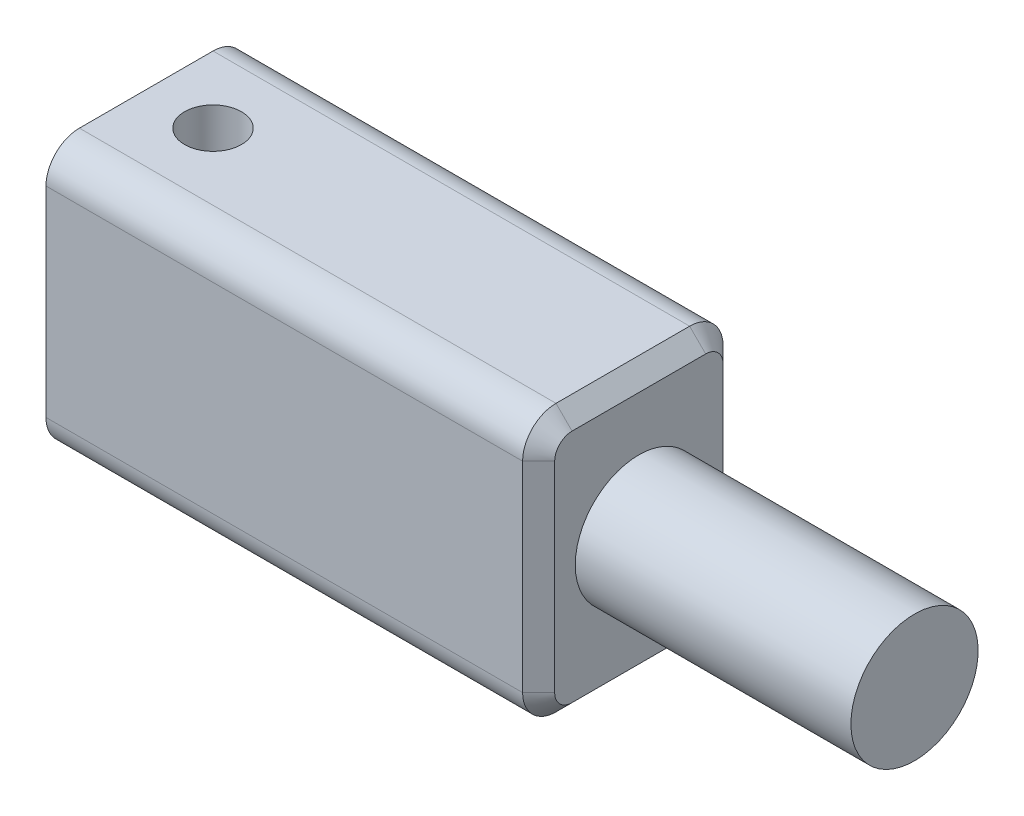
ISO-10303-21;
HEADER;
FILE_DESCRIPTION(('STEP AP214'),'2;1');
FILE_NAME('part.step','',(''),(''),'','','');
FILE_SCHEMA(('AUTOMOTIVE_DESIGN { 1 0 10303 214 1 1 1 1 }'));
ENDSEC;
DATA;
#1=APPLICATION_CONTEXT('core data for automotive mechanical design processes');
#2=APPLICATION_PROTOCOL_DEFINITION('international standard','automotive_design',2000,#1);
#3=PRODUCT_CONTEXT('',#1,'mechanical');
#4=PRODUCT('Part','Part','',(#3));
#5=PRODUCT_RELATED_PRODUCT_CATEGORY('part','',(#4));
#6=PRODUCT_DEFINITION_FORMATION('','',#4);
#7=PRODUCT_DEFINITION_CONTEXT('part definition',#1,'design');
#8=PRODUCT_DEFINITION('design','',#6,#7);
#9=PRODUCT_DEFINITION_SHAPE('','',#8);
#10=(LENGTH_UNIT() NAMED_UNIT(*) SI_UNIT(.MILLI.,.METRE.));
#11=(NAMED_UNIT(*) PLANE_ANGLE_UNIT() SI_UNIT($,.RADIAN.));
#12=(NAMED_UNIT(*) SI_UNIT($,.STERADIAN.) SOLID_ANGLE_UNIT());
#13=UNCERTAINTY_MEASURE_WITH_UNIT(LENGTH_MEASURE(1.E-05),#10,'distance_accuracy_value','');
#14=(GEOMETRIC_REPRESENTATION_CONTEXT(3) GLOBAL_UNCERTAINTY_ASSIGNED_CONTEXT((#13)) GLOBAL_UNIT_ASSIGNED_CONTEXT((#10,
#11,#12)) REPRESENTATION_CONTEXT('',''));
#15=CARTESIAN_POINT('',(0.,0.,0.));
#16=DIRECTION('',(0.,0.,1.));
#17=DIRECTION('',(1.,0.,0.));
#18=AXIS2_PLACEMENT_3D('',#15,#16,#17);
#19=CARTESIAN_POINT('',(39.28745,6.35,-4.7625));
#20=DIRECTION('',(0.,1.,0.));
#21=DIRECTION('',(0.,0.,1.));
#22=AXIS2_PLACEMENT_3D('',#19,#20,#21);
#23=PLANE('',#22);
#24=DIRECTION('',(-1.,0.,0.));
#25=VECTOR('',#24,1.);
#26=CARTESIAN_POINT('',(39.28745,6.35,3.175));
#27=LINE('',#26,#25);
#28=CARTESIAN_POINT('',(0.,6.35,3.175));
#29=VERTEX_POINT('',#28);
#30=CARTESIAN_POINT('',(22.65045,6.35,3.175));
#31=VERTEX_POINT('',#30);
#32=EDGE_CURVE('E491',#29,#31,#27,.F.);
#33=ORIENTED_EDGE('',*,*,#32,.T.);
#34=DIRECTION('',(0.,0.,-1.));
#35=VECTOR('',#34,1.);
#36=CARTESIAN_POINT('',(22.65045,6.35,-3.175));
#37=LINE('',#36,#35);
#38=CARTESIAN_POINT('',(22.65045,6.35,-3.175));
#39=VERTEX_POINT('',#38);
#40=EDGE_CURVE('E12',#31,#39,#37,.T.);
#41=ORIENTED_EDGE('',*,*,#40,.T.);
#42=DIRECTION('',(-1.,0.,0.));
#43=VECTOR('',#42,1.);
#44=CARTESIAN_POINT('',(39.28745,6.35,-3.175));
#45=LINE('',#44,#43);
#46=CARTESIAN_POINT('',(0.,6.35,-3.175));
#47=VERTEX_POINT('',#46);
#48=EDGE_CURVE('E493',#39,#47,#45,.T.);
#49=ORIENTED_EDGE('',*,*,#48,.T.);
#50=DIRECTION('',(0.,0.,-1.));
#51=VECTOR('',#50,1.);
#52=CARTESIAN_POINT('',(0.,6.35,-4.7625));
#53=LINE('',#52,#51);
#54=EDGE_CURVE('E454',#29,#47,#53,.T.);
#55=ORIENTED_EDGE('',*,*,#54,.F.);
#56=EDGE_LOOP('',(#33,#41,#49,#55));
#57=FACE_BOUND('',#56,.T.);
#58=CARTESIAN_POINT('',(3.175,6.35,0.));
#59=DIRECTION('',(0.,1.,0.));
#60=DIRECTION('',(0.,0.,1.));
#61=AXIS2_PLACEMENT_3D('',#58,#59,#60);
#62=CIRCLE('',#61,1.35255);
#63=CARTESIAN_POINT('',(3.175,6.35,1.35255));
#64=VERTEX_POINT('',#63);
#65=EDGE_CURVE('E568',#64,#64,#62,.T.);
#66=ORIENTED_EDGE('',*,*,#65,.F.);
#67=EDGE_LOOP('',(#66));
#68=FACE_BOUND('',#67,.T.);
#69=ADVANCED_FACE('F361',(#57,#68),#23,.T.);
#70=CARTESIAN_POINT('',(9.525,0.,0.));
#71=DIRECTION('',(-1.,0.,0.));
#72=DIRECTION('',(0.,0.,1.));
#73=AXIS2_PLACEMENT_3D('',#70,#71,#72);
#74=CYLINDRICAL_SURFACE('',#73,1.524);
#75=CARTESIAN_POINT('',(0.,0.,0.));
#76=DIRECTION('',(-1.,0.,0.));
#77=DIRECTION('',(0.,0.,1.));
#78=AXIS2_PLACEMENT_3D('',#75,#76,#77);
#79=CIRCLE('',#78,1.524);
#80=CARTESIAN_POINT('',(0.,0.,1.524));
#81=VERTEX_POINT('',#80);
#82=EDGE_CURVE('E663',#81,#81,#79,.T.);
#83=ORIENTED_EDGE('',*,*,#82,.T.);
#84=EDGE_LOOP('',(#83));
#85=FACE_BOUND('',#84,.T.);
#86=CARTESIAN_POINT('',(9.525,0.,0.));
#87=DIRECTION('',(-1.,0.,0.));
#88=DIRECTION('',(0.,0.,1.));
#89=AXIS2_PLACEMENT_3D('',#86,#87,#88);
#90=CIRCLE('',#89,1.524);
#91=CARTESIAN_POINT('',(9.525,0.,1.524));
#92=VERTEX_POINT('',#91);
#93=EDGE_CURVE('E469',#92,#92,#90,.T.);
#94=ORIENTED_EDGE('',*,*,#93,.F.);
#95=EDGE_LOOP('',(#94));
#96=FACE_BOUND('',#95,.T.);
#97=CARTESIAN_POINT('',(3.175,-0.702270957323452,1.35255));
#98=CARTESIAN_POINT('',(3.21707217968336,-0.702279979262497,1.35254717818324));
#99=CARTESIAN_POINT('',(3.2591643143721,-0.706141236265535,1.35056087661199));
#100=CARTESIAN_POINT('',(3.34184693441425,-0.720653947836462,1.3428680638871));
#101=CARTESIAN_POINT('',(3.38243196712902,-0.731327915477317,1.3371492168582));
#102=CARTESIAN_POINT('',(3.47957631490848,-0.763523860000407,1.31911937089296));
#103=CARTESIAN_POINT('',(3.53485012558653,-0.787779459464968,1.30498326977875));
#104=CARTESIAN_POINT('',(3.64094442790641,-0.841537752527547,1.27098829114154));
#105=CARTESIAN_POINT('',(3.69174649367795,-0.871060765628537,1.25110706036587));
#106=CARTESIAN_POINT('',(3.78085338917612,-0.926970786373431,1.21007746320126));
#107=CARTESIAN_POINT('',(3.81978213869841,-0.952992605080561,1.18977093749453));
#108=CARTESIAN_POINT('',(3.89523306169008,-1.00557944964072,1.14567324245321));
#109=CARTESIAN_POINT('',(3.93175381464058,-1.03214478422859,1.12188004246961));
#110=CARTESIAN_POINT('',(4.03772218242477,-1.11141960629747,1.04532115075714));
#111=CARTESIAN_POINT('',(4.10375714327414,-1.16382979548051,0.987292210958925));
#112=CARTESIAN_POINT('',(4.21080906979762,-1.2511587498098,0.872411103540684));
#113=CARTESIAN_POINT('',(4.25404882712305,-1.28728225322205,0.818528346752338));
#114=CARTESIAN_POINT('',(4.33294448831643,-1.35409562655333,0.702467042033983));
#115=CARTESIAN_POINT('',(4.36861337122796,-1.38479478025334,0.640302993841241));
#116=CARTESIAN_POINT('',(4.42456600797019,-1.43333461068743,0.521004660290256));
#117=CARTESIAN_POINT('',(4.44648803820053,-1.45251193129574,0.465187769180202));
#118=CARTESIAN_POINT('',(4.48302451531313,-1.48459940546605,0.349478423927672));
#119=CARTESIAN_POINT('',(4.4976433200318,-1.49751329628366,0.289588424509329));
#120=CARTESIAN_POINT('',(4.51866145662187,-1.5161089677639,0.166903556635082));
#121=CARTESIAN_POINT('',(4.52501436302095,-1.52174989820533,0.104094315594963));
#122=CARTESIAN_POINT('',(4.52883977769142,-1.52514445578943,-0.0220041355046523));
#123=CARTESIAN_POINT('',(4.52631460610187,-1.52290014361013,-0.0852932158525667));
#124=CARTESIAN_POINT('',(4.51323018247251,-1.51130303702087,-0.204441240571813));
#125=CARTESIAN_POINT('',(4.5034229544322,-1.50261571002647,-0.260452224794975));
#126=CARTESIAN_POINT('',(4.47726068872912,-1.47953693873412,-0.369682348683285));
#127=CARTESIAN_POINT('',(4.46090401488295,-1.46514406908574,-0.422900786953862));
#128=CARTESIAN_POINT('',(4.4212725144013,-1.43048290746596,-0.528760852731155));
#129=CARTESIAN_POINT('',(4.39763164437999,-1.40990567138485,-0.581162156614216));
#130=CARTESIAN_POINT('',(4.34491879370703,-1.36444751224133,-0.681085210018799));
#131=CARTESIAN_POINT('',(4.31584569876128,-1.33956570627468,-0.728605955302902));
#132=CARTESIAN_POINT('',(4.23676721794219,-1.27274377861347,-0.842025451480227));
#133=CARTESIAN_POINT('',(4.18375404315887,-1.22867618797298,-0.904579116775021));
#134=CARTESIAN_POINT('',(4.06909452295249,-1.13639682691843,-1.0181100655927));
#135=CARTESIAN_POINT('',(4.00740910463329,-1.0881667045469,-1.06903205444617));
#136=CARTESIAN_POINT('',(3.90832153448637,-1.01510729575818,-1.13722597152992));
#137=CARTESIAN_POINT('',(3.87375220166363,-0.990339529947954,-1.15879547172421));
#138=CARTESIAN_POINT('',(3.80244417231138,-0.941378567028568,-1.19890874898346));
#139=CARTESIAN_POINT('',(3.76570380499716,-0.917185833068511,-1.21745015327655));
#140=CARTESIAN_POINT('',(3.69008436595362,-0.870411845890656,-1.25131443016785));
#141=CARTESIAN_POINT('',(3.65121752518315,-0.847822804532961,-1.26665367715588));
#142=CARTESIAN_POINT('',(3.57090820653243,-0.805459169212386,-1.2940030210235));
#143=CARTESIAN_POINT('',(3.52947082334065,-0.785679248590163,-1.30601946074904));
#144=CARTESIAN_POINT('',(3.45022121831267,-0.75354551810751,-1.32477883385933));
#145=CARTESIAN_POINT('',(3.41281487347676,-0.740520008441139,-1.33204562784078));
#146=CARTESIAN_POINT('',(3.33619456686584,-0.719598636268923,-1.34346507565195));
#147=CARTESIAN_POINT('',(3.2969870537631,-0.711685800898481,-1.34762804061677));
#148=CARTESIAN_POINT('',(3.21710797519513,-0.702409401308774,-1.35249026637018));
#149=CARTESIAN_POINT('',(3.17642523200408,-0.701116833495169,-1.35315198189233));
#150=CARTESIAN_POINT('',(3.09553088696961,-0.705591670023033,-1.35082197843788));
#151=CARTESIAN_POINT('',(3.0553200575734,-0.71136935906665,-1.34782493729041));
#152=CARTESIAN_POINT('',(2.96792599485148,-0.730653206610229,-1.33748273346956));
#153=CARTESIAN_POINT('',(2.92117236186777,-0.745588304634533,-1.32932118208931));
#154=CARTESIAN_POINT('',(2.83073217898877,-0.780994820452487,-1.30883118995821));
#155=CARTESIAN_POINT('',(2.78705800023929,-0.801487125720679,-1.29648698358507));
#156=CARTESIAN_POINT('',(2.70657947746851,-0.843530277280837,-1.26948792522576));
#157=CARTESIAN_POINT('',(2.66951485821868,-0.864802087293333,-1.25515789758804));
#158=CARTESIAN_POINT('',(2.59748189898453,-0.908791447443696,-1.22368658903565));
#159=CARTESIAN_POINT('',(2.56251517718985,-0.931510086426917,-1.20654317516912));
#160=CARTESIAN_POINT('',(2.46039851996664,-1.00064820268408,-1.15098258898917));
#161=CARTESIAN_POINT('',(2.39608199798879,-1.04802113948181,-1.1084522840693));
#162=CARTESIAN_POINT('',(2.27070372804145,-1.14422575019542,-1.0091837203809));
#163=CARTESIAN_POINT('',(2.21015767539551,-1.19293882226644,-0.951678112407259));
#164=CARTESIAN_POINT('',(2.09902154373213,-1.28449682649553,-0.823882868449129));
#165=CARTESIAN_POINT('',(2.04840177038203,-1.32735914047292,-0.753632610525875));
#166=CARTESIAN_POINT('',(1.97407854020015,-1.39110139465381,-0.625138330755869));
#167=CARTESIAN_POINT('',(1.94693733014504,-1.41463456160875,-0.570197342077547));
#168=CARTESIAN_POINT('',(1.89983630684233,-1.45571040309329,-0.455192241264111));
#169=CARTESIAN_POINT('',(1.87987167295367,-1.47325709844374,-0.395131601769294));
#170=CARTESIAN_POINT('',(1.84825012351509,-1.50113078852859,-0.270691843317126));
#171=CARTESIAN_POINT('',(1.83665787260538,-1.51140157591453,-0.206283225701143));
#172=CARTESIAN_POINT('',(1.82297811137812,-1.52352783509803,-0.0756874888437563));
#173=CARTESIAN_POINT('',(1.82088452196937,-1.52538868920375,-0.00950153438310301));
#174=CARTESIAN_POINT('',(1.8260402528428,-1.52081442502809,0.114416735355444));
#175=CARTESIAN_POINT('',(1.83222731326676,-1.51532250764779,0.172233851767758));
#176=CARTESIAN_POINT('',(1.85171165075638,-1.4980841090639,0.285679418145234));
#177=CARTESIAN_POINT('',(1.86500979574868,-1.48633686438186,0.341307600055206));
#178=CARTESIAN_POINT('',(1.89819349259866,-1.45717382833434,0.44992535727258));
#179=CARTESIAN_POINT('',(1.91817426416168,-1.43967616673655,0.502863253682306));
#180=CARTESIAN_POINT('',(1.96372547923972,-1.40008735638288,0.604406875098513));
#181=CARTESIAN_POINT('',(1.98929839165491,-1.37799417894228,0.653010673238715));
#182=CARTESIAN_POINT('',(2.05865277909166,-1.31869140295251,0.76784024535857));
#183=CARTESIAN_POINT('',(2.10526627176798,-1.27933163768512,0.831252992794772));
#184=CARTESIAN_POINT('',(2.20672301106169,-1.19578970513987,0.94753267865525));
#185=CARTESIAN_POINT('',(2.26158852232377,-1.15159458238565,1.00037015658202));
#186=CARTESIAN_POINT('',(2.3796383931867,-1.06033696777279,1.0966905635919));
#187=CARTESIAN_POINT('',(2.44297795272761,-1.01323298272958,1.139944603812));
#188=CARTESIAN_POINT('',(2.54349555096642,-0.944142696962623,1.19668945693576));
#189=CARTESIAN_POINT('',(2.57790705707033,-0.921380886359577,1.21424387045927));
#190=CARTESIAN_POINT('',(2.64876636319789,-0.87711865651036,1.24659001415373));
#191=CARTESIAN_POINT('',(2.68521266158619,-0.855617330460224,1.26138374753475));
#192=CARTESIAN_POINT('',(2.76272124728248,-0.813651054483193,1.28888076750124));
#193=CARTESIAN_POINT('',(2.80392956253207,-0.793330991337368,1.30139972257987));
#194=CARTESIAN_POINT('',(2.88917980052923,-0.757231243757115,1.32273075371325));
#195=CARTESIAN_POINT('',(2.93321346873306,-0.741439009371421,1.33155310775882));
#196=CARTESIAN_POINT('',(3.01037129337357,-0.720661433028069,1.34287789414377));
#197=CARTESIAN_POINT('',(3.04283129557991,-0.713857614010815,1.34648053559675));
#198=CARTESIAN_POINT('',(3.10852414729912,-0.704661911686318,1.35131603825143));
#199=CARTESIAN_POINT('',(3.14175584401672,-0.702263828461787,1.35255222971372));
#200=CARTESIAN_POINT('',(3.175,-0.702270957323452,1.35255));
#201=B_SPLINE_CURVE_WITH_KNOTS('',3,(#97,#98,#99,#100,#101,#102,#103,#104,#105,#106,#107,#108,
#109,#110,#111,#112,#113,#114,#115,#116,#117,#118,#119,#120,#121,#122,#123,#124,#125,#126,#127,
#128,#129,#130,#131,#132,#133,#134,#135,#136,#137,#138,#139,#140,#141,#142,#143,#144,#145,#146,
#147,#148,#149,#150,#151,#152,#153,#154,#155,#156,#157,#158,#159,#160,#161,#162,#163,#164,#165,
#166,#167,#168,#169,#170,#171,#172,#173,#174,#175,#176,#177,#178,#179,#180,#181,#182,#183,#184,
#185,#186,#187,#188,#189,#190,#191,#192,#193,#194,#195,#196,#197,#198,#199,#200),.UNSPECIFIED.,
.T.,.F.,(4,2,2,2,2,2,2,2,2,2,2,2,2,2,2,2,2,2,2,2,2,2,2,2,2,2,2,2,2,2,2,2,2,2,2,2,2,2,2,2,2,2,2,
2,2,2,2,2,2,2,2,4),(0.,0.126063369193998,0.252545495709718,0.437479934952307,0.623143838396348,
0.776063927680587,0.929073434650462,1.23439828791887,1.46749024436466,1.70017931576062,
1.88829730084201,2.07630290140219,2.26535994238806,2.45436758011159,2.62617526171937,
2.79802589114982,2.98053101244574,3.16307361158685,3.44084358107695,3.71990773794989,
3.86284266811253,4.00588906812932,4.14818503530543,4.29020747117032,4.41064990338174,
4.53069041254542,4.65201559213964,4.77351746658282,4.92194493525667,5.07093821082692,
5.20597279661751,5.34111023507301,5.61156354361266,5.90033933011229,6.18823760822231,
6.38443434883885,6.58049905305646,6.77806233685239,6.97549916337932,7.14988497386687,
7.32429207346217,7.50129839279643,7.67838301781703,7.94091316310625,8.20416478347162,
8.47315188413674,8.60755574743725,8.74186170186414,8.88442113164787,9.02658151740235,
9.12633343769168,9.22594487548273),.UNSPECIFIED.);
#202=CARTESIAN_POINT('',(3.175,-0.702270957323452,1.35255));
#203=VERTEX_POINT('',#202);
#204=EDGE_CURVE('E666',#203,#203,#201,.T.);
#205=ORIENTED_EDGE('',*,*,#204,.F.);
#206=EDGE_LOOP('',(#205));
#207=FACE_BOUND('',#206,.T.);
#208=CARTESIAN_POINT('',(3.175,0.702270957323452,-1.35255));
#209=CARTESIAN_POINT('',(3.13292782031664,0.702279979262497,-1.35254717818324));
#210=CARTESIAN_POINT('',(3.09083568562791,0.706141236265535,-1.35056087661199));
#211=CARTESIAN_POINT('',(3.00815306558575,0.720653947836462,-1.3428680638871));
#212=CARTESIAN_POINT('',(2.96756803287098,0.731327915477317,-1.3371492168582));
#213=CARTESIAN_POINT('',(2.87042368509153,0.763523860000406,-1.31911937089296));
#214=CARTESIAN_POINT('',(2.81514987441348,0.787779459464967,-1.30498326977875));
#215=CARTESIAN_POINT('',(2.70905557209359,0.841537752527545,-1.27098829114155));
#216=CARTESIAN_POINT('',(2.65825350632205,0.871060765628536,-1.25110706036587));
#217=CARTESIAN_POINT('',(2.56914661082389,0.926970786373429,-1.21007746320126));
#218=CARTESIAN_POINT('',(2.5302178613016,0.952992605080559,-1.18977093749453));
#219=CARTESIAN_POINT('',(2.45476693830992,1.00557944964072,-1.14567324245321));
#220=CARTESIAN_POINT('',(2.41824618535943,1.03214478422859,-1.12188004246961));
#221=CARTESIAN_POINT('',(2.31227781757523,1.11141960629746,-1.04532115075715));
#222=CARTESIAN_POINT('',(2.24624285672587,1.1638297954805,-0.987292210958928));
#223=CARTESIAN_POINT('',(2.13919093020239,1.25115874980979,-0.872411103540687));
#224=CARTESIAN_POINT('',(2.09595117287696,1.28728225322204,-0.818528346752341));
#225=CARTESIAN_POINT('',(2.01705551168357,1.35409562655333,-0.702467042033986));
#226=CARTESIAN_POINT('',(1.98138662877205,1.38479478025334,-0.640302993841243));
#227=CARTESIAN_POINT('',(1.92543399202981,1.43333461068743,-0.521004660290258));
#228=CARTESIAN_POINT('',(1.90351196179947,1.45251193129574,-0.465187769180204));
#229=CARTESIAN_POINT('',(1.86697548468687,1.48459940546604,-0.349478423927675));
#230=CARTESIAN_POINT('',(1.8523566799682,1.49751329628366,-0.289588424509331));
#231=CARTESIAN_POINT('',(1.83133854337813,1.5161089677639,-0.166903556635084));
#232=CARTESIAN_POINT('',(1.82498563697905,1.52174989820533,-0.104094315594965));
#233=CARTESIAN_POINT('',(1.82116022230858,1.52514445578943,0.0220041355046508));
#234=CARTESIAN_POINT('',(1.82368539389813,1.52290014361013,0.0852932158525652));
#235=CARTESIAN_POINT('',(1.83676981752749,1.51130303702087,0.204441240571811));
#236=CARTESIAN_POINT('',(1.8465770455678,1.50261571002648,0.260452224794973));
#237=CARTESIAN_POINT('',(1.87273931127088,1.47953693873412,0.369682348683283));
#238=CARTESIAN_POINT('',(1.88909598511706,1.46514406908574,0.422900786953861));
#239=CARTESIAN_POINT('',(1.9287274855987,1.43048290746596,0.528760852731154));
#240=CARTESIAN_POINT('',(1.95236835562001,1.40990567138485,0.581162156614215));
#241=CARTESIAN_POINT('',(2.00508120629297,1.36444751224134,0.681085210018798));
#242=CARTESIAN_POINT('',(2.03415430123872,1.33956570627468,0.728605955302901));
#243=CARTESIAN_POINT('',(2.11323278205781,1.27274377861347,0.842025451480226));
#244=CARTESIAN_POINT('',(2.16624595684113,1.22867618797298,0.90457911677502));
#245=CARTESIAN_POINT('',(2.28090547704751,1.13639682691844,1.0181100655927));
#246=CARTESIAN_POINT('',(2.34259089536671,1.0881667045469,1.06903205444617));
#247=CARTESIAN_POINT('',(2.44167846551363,1.01510729575818,1.13722597152992));
#248=CARTESIAN_POINT('',(2.47624779833637,0.990339529947954,1.15879547172421));
#249=CARTESIAN_POINT('',(2.54755582768862,0.941378567028568,1.19890874898346));
#250=CARTESIAN_POINT('',(2.58429619500284,0.917185833068512,1.21745015327655));
#251=CARTESIAN_POINT('',(2.65991563404638,0.870411845890657,1.25131443016785));
#252=CARTESIAN_POINT('',(2.69878247481685,0.847822804532962,1.26665367715588));
#253=CARTESIAN_POINT('',(2.77909179346757,0.805459169212386,1.29400302102349));
#254=CARTESIAN_POINT('',(2.82052917665935,0.785679248590163,1.30601946074904));
#255=CARTESIAN_POINT('',(2.89977878168733,0.75354551810751,1.32477883385933));
#256=CARTESIAN_POINT('',(2.93718512652324,0.74052000844114,1.33204562784078));
#257=CARTESIAN_POINT('',(3.01380543313416,0.719598636268924,1.34346507565195));
#258=CARTESIAN_POINT('',(3.0530129462369,0.711685800898481,1.34762804061677));
#259=CARTESIAN_POINT('',(3.13289202480486,0.702409401308774,1.35249026637018));
#260=CARTESIAN_POINT('',(3.17357476799592,0.701116833495169,1.35315198189233));
#261=CARTESIAN_POINT('',(3.25446911303039,0.705591670023033,1.35082197843788));
#262=CARTESIAN_POINT('',(3.2946799424266,0.711369359066649,1.34782493729041));
#263=CARTESIAN_POINT('',(3.38207400514852,0.730653206610228,1.33748273346957));
#264=CARTESIAN_POINT('',(3.42882763813223,0.745588304634532,1.32932118208931));
#265=CARTESIAN_POINT('',(3.51926782101123,0.780994820452486,1.30883118995821));
#266=CARTESIAN_POINT('',(3.56294199976071,0.801487125720678,1.29648698358507));
#267=CARTESIAN_POINT('',(3.64342052253149,0.843530277280835,1.26948792522577));
#268=CARTESIAN_POINT('',(3.68048514178132,0.864802087293331,1.25515789758804));
#269=CARTESIAN_POINT('',(3.75251810101547,0.908791447443695,1.22368658903565));
#270=CARTESIAN_POINT('',(3.78748482281015,0.931510086426917,1.20654317516912));
#271=CARTESIAN_POINT('',(3.88960148003336,1.00064820268408,1.15098258898917));
#272=CARTESIAN_POINT('',(3.95391800201121,1.04802113948181,1.1084522840693));
#273=CARTESIAN_POINT('',(4.07929627195855,1.14422575019542,1.0091837203809));
#274=CARTESIAN_POINT('',(4.13984232460449,1.19293882226644,0.951678112407258));
#275=CARTESIAN_POINT('',(4.25097845626788,1.28449682649553,0.823882868449127));
#276=CARTESIAN_POINT('',(4.30159822961797,1.32735914047292,0.753632610525872));
#277=CARTESIAN_POINT('',(4.37592145979985,1.39110139465382,0.625138330755867));
#278=CARTESIAN_POINT('',(4.40306266985496,1.41463456160875,0.570197342077545));
#279=CARTESIAN_POINT('',(4.45016369315767,1.4557104030933,0.455192241264108));
#280=CARTESIAN_POINT('',(4.47012832704634,1.47325709844374,0.395131601769292));
#281=CARTESIAN_POINT('',(4.50174987648491,1.50113078852859,0.270691843317123));
#282=CARTESIAN_POINT('',(4.51334212739462,1.51140157591453,0.206283225701141));
#283=CARTESIAN_POINT('',(4.52702188862188,1.52352783509803,0.0756874888437545));
#284=CARTESIAN_POINT('',(4.52911547803063,1.52538868920375,0.00950153438310112));
#285=CARTESIAN_POINT('',(4.5239597471572,1.52081442502809,-0.114416735355446));
#286=CARTESIAN_POINT('',(4.51777268673324,1.51532250764779,-0.17223385176776));
#287=CARTESIAN_POINT('',(4.49828834924362,1.4980841090639,-0.285679418145236));
#288=CARTESIAN_POINT('',(4.48499020425132,1.48633686438186,-0.341307600055208));
#289=CARTESIAN_POINT('',(4.45180650740135,1.45717382833434,-0.449925357272581));
#290=CARTESIAN_POINT('',(4.43182573583832,1.43967616673655,-0.502863253682307));
#291=CARTESIAN_POINT('',(4.38627452076028,1.40008735638288,-0.604406875098515));
#292=CARTESIAN_POINT('',(4.36070160834509,1.37799417894228,-0.653010673238716));
#293=CARTESIAN_POINT('',(4.29134722090834,1.31869140295251,-0.76784024535857));
#294=CARTESIAN_POINT('',(4.24473372823202,1.27933163768512,-0.831252992794773));
#295=CARTESIAN_POINT('',(4.14327698893831,1.19578970513987,-0.947532678655251));
#296=CARTESIAN_POINT('',(4.08841147767623,1.15159458238565,-1.00037015658202));
#297=CARTESIAN_POINT('',(3.9703616068133,1.06033696777279,-1.0966905635919));
#298=CARTESIAN_POINT('',(3.90702204727239,1.01323298272958,-1.139944603812));
#299=CARTESIAN_POINT('',(3.80650444903359,0.944142696962624,-1.19668945693576));
#300=CARTESIAN_POINT('',(3.77209294292968,0.921380886359578,-1.21424387045927));
#301=CARTESIAN_POINT('',(3.70123363680212,0.87711865651036,-1.24659001415372));
#302=CARTESIAN_POINT('',(3.66478733841381,0.855617330460224,-1.26138374753475));
#303=CARTESIAN_POINT('',(3.58727875271752,0.813651054483192,-1.28888076750124));
#304=CARTESIAN_POINT('',(3.54607043746793,0.793330991337368,-1.30139972257987));
#305=CARTESIAN_POINT('',(3.46082019947077,0.757231243757114,-1.32273075371325));
#306=CARTESIAN_POINT('',(3.41678653126694,0.741439009371421,-1.33155310775882));
#307=CARTESIAN_POINT('',(3.33962870662643,0.720661433028069,-1.34287789414377));
#308=CARTESIAN_POINT('',(3.30716870442009,0.713857614010815,-1.34648053559675));
#309=CARTESIAN_POINT('',(3.24147585270088,0.704661911686318,-1.35131603825143));
#310=CARTESIAN_POINT('',(3.20824415598328,0.702263828461787,-1.35255222971372));
#311=CARTESIAN_POINT('',(3.175,0.702270957323452,-1.35255));
#312=B_SPLINE_CURVE_WITH_KNOTS('',3,(#208,#209,#210,#211,#212,#213,#214,#215,#216,#217,#218,
#219,#220,#221,#222,#223,#224,#225,#226,#227,#228,#229,#230,#231,#232,#233,#234,#235,#236,#237,
#238,#239,#240,#241,#242,#243,#244,#245,#246,#247,#248,#249,#250,#251,#252,#253,#254,#255,#256,
#257,#258,#259,#260,#261,#262,#263,#264,#265,#266,#267,#268,#269,#270,#271,#272,#273,#274,#275,
#276,#277,#278,#279,#280,#281,#282,#283,#284,#285,#286,#287,#288,#289,#290,#291,#292,#293,#294,
#295,#296,#297,#298,#299,#300,#301,#302,#303,#304,#305,#306,#307,#308,#309,#310,#311),
.UNSPECIFIED.,.T.,.F.,(4,2,2,2,2,2,2,2,2,2,2,2,2,2,2,2,2,2,2,2,2,2,2,2,2,2,2,2,2,2,2,2,2,2,2,2,
2,2,2,2,2,2,2,2,2,2,2,2,2,2,2,4),(0.,0.126063369193998,0.252545495709717,0.437479934952305,
0.623143838396345,0.776063927680584,0.929073434650458,1.23439828791887,1.46749024436466,
1.70017931576062,1.88829730084201,2.07630290140219,2.26535994238806,2.45436758011159,
2.62617526171937,2.79802589114982,2.98053101244574,3.16307361158685,3.44084358107695,
3.71990773794989,3.86284266811252,4.00588906812931,4.14818503530542,4.29020747117032,
4.41064990338174,4.53069041254541,4.65201559213964,4.77351746658282,4.92194493525667,
5.07093821082692,5.20597279661751,5.34111023507301,5.61156354361265,5.90033933011229,
6.18823760822231,6.38443434883885,6.58049905305646,6.77806233685239,6.97549916337932,
7.14988497386687,7.32429207346217,7.50129839279643,7.67838301781703,7.94091316310625,
8.20416478347162,8.47315188413674,8.60755574743725,8.74186170186414,8.88442113164787,
9.02658151740235,9.12633343769168,9.22594487548273),.UNSPECIFIED.);
#313=CARTESIAN_POINT('',(3.175,0.702270957323452,-1.35255));
#314=VERTEX_POINT('',#313);
#315=EDGE_CURVE('E561',#314,#314,#312,.T.);
#316=ORIENTED_EDGE('',*,*,#315,.T.);
#317=EDGE_LOOP('',(#316));
#318=FACE_BOUND('',#317,.T.);
#319=ADVANCED_FACE('F617',(#85,#96,#207,#318),#74,.F.);
#320=CARTESIAN_POINT('',(23.41245,4.7625,0.));
#321=DIRECTION('',(-1.,0.,0.));
#322=DIRECTION('',(0.,0.,1.));
#323=AXIS2_PLACEMENT_3D('',#320,#321,#322);
#324=PLANE('',#323);
#325=CARTESIAN_POINT('',(23.41245,-4.7625,3.175));
#326=DIRECTION('',(-1.,0.,0.));
#327=DIRECTION('',(0.,0.,1.));
#328=AXIS2_PLACEMENT_3D('',#325,#326,#327);
#329=CIRCLE('',#328,0.825500000000002);
#330=CARTESIAN_POINT('',(23.41245,-4.7625,4.0005));
#331=VERTEX_POINT('',#330);
#332=CARTESIAN_POINT('',(23.41245,-5.588,3.175));
#333=VERTEX_POINT('',#332);
#334=EDGE_CURVE('E510',#331,#333,#329,.F.);
#335=ORIENTED_EDGE('',*,*,#334,.T.);
#336=DIRECTION('',(0.,0.,-1.));
#337=VECTOR('',#336,1.);
#338=CARTESIAN_POINT('',(23.41245,-5.588,-3.175));
#339=LINE('',#338,#337);
#340=CARTESIAN_POINT('',(23.41245,-5.588,-3.175));
#341=VERTEX_POINT('',#340);
#342=EDGE_CURVE('E514',#333,#341,#339,.T.);
#343=ORIENTED_EDGE('',*,*,#342,.T.);
#344=CARTESIAN_POINT('',(23.41245,-4.7625,-3.175));
#345=DIRECTION('',(-1.,0.,0.));
#346=DIRECTION('',(0.,0.,1.));
#347=AXIS2_PLACEMENT_3D('',#344,#345,#346);
#348=CIRCLE('',#347,0.825500000000001);
#349=CARTESIAN_POINT('',(23.41245,-4.7625,-4.0005));
#350=VERTEX_POINT('',#349);
#351=EDGE_CURVE('E512',#341,#350,#348,.F.);
#352=ORIENTED_EDGE('',*,*,#351,.T.);
#353=DIRECTION('',(0.,1.,0.));
#354=VECTOR('',#353,1.);
#355=CARTESIAN_POINT('',(23.41245,4.7625,-4.0005));
#356=LINE('',#355,#354);
#357=CARTESIAN_POINT('',(23.41245,4.7625,-4.0005));
#358=VERTEX_POINT('',#357);
#359=EDGE_CURVE('E508',#350,#358,#356,.T.);
#360=ORIENTED_EDGE('',*,*,#359,.T.);
#361=CARTESIAN_POINT('',(23.41245,4.7625,-3.175));
#362=DIRECTION('',(-1.,0.,0.));
#363=DIRECTION('',(0.,0.,1.));
#364=AXIS2_PLACEMENT_3D('',#361,#362,#363);
#365=CIRCLE('',#364,0.825500000000002);
#366=CARTESIAN_POINT('',(23.41245,5.588,-3.175));
#367=VERTEX_POINT('',#366);
#368=EDGE_CURVE('E504',#358,#367,#365,.F.);
#369=ORIENTED_EDGE('',*,*,#368,.T.);
#370=DIRECTION('',(0.,0.,1.));
#371=VECTOR('',#370,1.);
#372=CARTESIAN_POINT('',(23.41245,5.588,3.175));
#373=LINE('',#372,#371);
#374=CARTESIAN_POINT('',(23.41245,5.588,3.175));
#375=VERTEX_POINT('',#374);
#376=EDGE_CURVE('E500',#367,#375,#373,.T.);
#377=ORIENTED_EDGE('',*,*,#376,.T.);
#378=CARTESIAN_POINT('',(23.41245,4.7625,3.175));
#379=DIRECTION('',(-1.,0.,0.));
#380=DIRECTION('',(0.,0.,1.));
#381=AXIS2_PLACEMENT_3D('',#378,#379,#380);
#382=CIRCLE('',#381,0.825500000000001);
#383=CARTESIAN_POINT('',(23.41245,4.7625,4.0005));
#384=VERTEX_POINT('',#383);
#385=EDGE_CURVE('E502',#375,#384,#382,.F.);
#386=ORIENTED_EDGE('',*,*,#385,.T.);
#387=DIRECTION('',(0.,-1.,0.));
#388=VECTOR('',#387,1.);
#389=CARTESIAN_POINT('',(23.41245,-4.7625,4.0005));
#390=LINE('',#389,#388);
#391=EDGE_CURVE('E506',#384,#331,#390,.T.);
#392=ORIENTED_EDGE('',*,*,#391,.T.);
#393=EDGE_LOOP('',(#335,#343,#352,#360,#369,#377,#386,#392));
#394=FACE_BOUND('',#393,.T.);
#395=CARTESIAN_POINT('',(23.41245,0.,0.));
#396=DIRECTION('',(-1.,0.,0.));
#397=DIRECTION('',(0.,0.,1.));
#398=AXIS2_PLACEMENT_3D('',#395,#396,#397);
#399=CIRCLE('',#398,3.0226);
#400=CARTESIAN_POINT('',(23.41245,0.,3.0226));
#401=VERTEX_POINT('',#400);
#402=EDGE_CURVE('E474',#401,#401,#399,.T.);
#403=ORIENTED_EDGE('',*,*,#402,.T.);
#404=EDGE_LOOP('',(#403));
#405=FACE_BOUND('',#404,.T.);
#406=ADVANCED_FACE('F624',(#394,#405),#324,.F.);
#407=CARTESIAN_POINT('',(0.,0.,0.));
#408=DIRECTION('',(-1.,0.,0.));
#409=DIRECTION('',(0.,0.,1.));
#410=AXIS2_PLACEMENT_3D('',#407,#408,#409);
#411=CYLINDRICAL_SURFACE('',#410,3.0226);
#412=ORIENTED_EDGE('',*,*,#402,.F.);
#413=EDGE_LOOP('',(#412));
#414=FACE_BOUND('',#413,.T.);
#415=CARTESIAN_POINT('',(36.5125,0.,0.));
#416=DIRECTION('',(-1.,0.,0.));
#417=DIRECTION('',(0.,0.,1.));
#418=AXIS2_PLACEMENT_3D('',#415,#416,#417);
#419=CIRCLE('',#418,3.0226);
#420=CARTESIAN_POINT('',(36.5125,0.,3.0226));
#421=VERTEX_POINT('',#420);
#422=EDGE_CURVE('E479',#421,#421,#419,.T.);
#423=ORIENTED_EDGE('',*,*,#422,.T.);
#424=EDGE_LOOP('',(#423));
#425=FACE_BOUND('',#424,.T.);
#426=ADVANCED_FACE('F641',(#414,#425),#411,.T.);
#427=CARTESIAN_POINT('',(36.5125,3.0226,0.));
#428=DIRECTION('',(-1.,0.,0.));
#429=DIRECTION('',(0.,0.,1.));
#430=AXIS2_PLACEMENT_3D('',#427,#428,#429);
#431=PLANE('',#430);
#432=ORIENTED_EDGE('',*,*,#422,.F.);
#433=EDGE_LOOP('',(#432));
#434=FACE_BOUND('',#433,.T.);
#435=ADVANCED_FACE('F638',(#434),#431,.F.);
#436=CARTESIAN_POINT('',(39.28745,-6.35,-4.7625));
#437=DIRECTION('',(0.,0.,-1.));
#438=DIRECTION('',(-1.,0.,0.));
#439=AXIS2_PLACEMENT_3D('',#436,#437,#438);
#440=PLANE('',#439);
#441=DIRECTION('',(-1.,0.,0.));
#442=VECTOR('',#441,1.);
#443=CARTESIAN_POINT('',(39.28745,4.7625,-4.7625));
#444=LINE('',#443,#442);
#445=CARTESIAN_POINT('',(0.,4.7625,-4.7625));
#446=VERTEX_POINT('',#445);
#447=CARTESIAN_POINT('',(22.65045,4.7625,-4.7625));
#448=VERTEX_POINT('',#447);
#449=EDGE_CURVE('E463',#446,#448,#444,.F.);
#450=ORIENTED_EDGE('',*,*,#449,.T.);
#451=DIRECTION('',(0.,-1.,0.));
#452=VECTOR('',#451,1.);
#453=CARTESIAN_POINT('',(22.65045,-4.7625,-4.7625));
#454=LINE('',#453,#452);
#455=CARTESIAN_POINT('',(22.65045,-4.7625,-4.7625));
#456=VERTEX_POINT('',#455);
#457=EDGE_CURVE('E524',#448,#456,#454,.T.);
#458=ORIENTED_EDGE('',*,*,#457,.T.);
#459=DIRECTION('',(-1.,0.,0.));
#460=VECTOR('',#459,1.);
#461=CARTESIAN_POINT('',(39.28745,-4.7625,-4.7625));
#462=LINE('',#461,#460);
#463=CARTESIAN_POINT('',(0.,-4.7625,-4.7625));
#464=VERTEX_POINT('',#463);
#465=EDGE_CURVE('E466',#456,#464,#462,.T.);
#466=ORIENTED_EDGE('',*,*,#465,.T.);
#467=DIRECTION('',(0.,-1.,0.));
#468=VECTOR('',#467,1.);
#469=CARTESIAN_POINT('',(0.,-6.35,-4.7625));
#470=LINE('',#469,#468);
#471=EDGE_CURVE('E452',#446,#464,#470,.T.);
#472=ORIENTED_EDGE('',*,*,#471,.F.);
#473=EDGE_LOOP('',(#450,#458,#466,#472));
#474=FACE_BOUND('',#473,.T.);
#475=ADVANCED_FACE('F462',(#474),#440,.T.);
#476=CARTESIAN_POINT('',(39.28745,-6.35,4.7625));
#477=DIRECTION('',(0.,0.,1.));
#478=DIRECTION('',(1.,0.,0.));
#479=AXIS2_PLACEMENT_3D('',#476,#477,#478);
#480=PLANE('',#479);
#481=DIRECTION('',(-1.,0.,0.));
#482=VECTOR('',#481,1.);
#483=CARTESIAN_POINT('',(39.28745,-4.7625,4.7625));
#484=LINE('',#483,#482);
#485=CARTESIAN_POINT('',(0.,-4.7625,4.7625));
#486=VERTEX_POINT('',#485);
#487=CARTESIAN_POINT('',(22.65045,-4.7625,4.7625));
#488=VERTEX_POINT('',#487);
#489=EDGE_CURVE('E495',#486,#488,#484,.F.);
#490=ORIENTED_EDGE('',*,*,#489,.T.);
#491=DIRECTION('',(0.,1.,0.));
#492=VECTOR('',#491,1.);
#493=CARTESIAN_POINT('',(22.65045,4.7625,4.7625));
#494=LINE('',#493,#492);
#495=CARTESIAN_POINT('',(22.65045,4.7625,4.7625));
#496=VERTEX_POINT('',#495);
#497=EDGE_CURVE('E526',#488,#496,#494,.T.);
#498=ORIENTED_EDGE('',*,*,#497,.T.);
#499=DIRECTION('',(-1.,0.,0.));
#500=VECTOR('',#499,1.);
#501=CARTESIAN_POINT('',(39.28745,4.7625,4.7625));
#502=LINE('',#501,#500);
#503=CARTESIAN_POINT('',(0.,4.7625,4.7625));
#504=VERTEX_POINT('',#503);
#505=EDGE_CURVE('E498',#496,#504,#502,.T.);
#506=ORIENTED_EDGE('',*,*,#505,.T.);
#507=DIRECTION('',(0.,1.,0.));
#508=VECTOR('',#507,1.);
#509=CARTESIAN_POINT('',(0.,-6.35,4.7625));
#510=LINE('',#509,#508);
#511=EDGE_CURVE('E655',#486,#504,#510,.T.);
#512=ORIENTED_EDGE('',*,*,#511,.F.);
#513=EDGE_LOOP('',(#490,#498,#506,#512));
#514=FACE_BOUND('',#513,.T.);
#515=ADVANCED_FACE('F530',(#514),#480,.T.);
#516=CARTESIAN_POINT('',(39.28745,-6.35,-4.7625));
#517=DIRECTION('',(0.,-1.,0.));
#518=DIRECTION('',(0.,0.,-1.));
#519=AXIS2_PLACEMENT_3D('',#516,#517,#518);
#520=PLANE('',#519);
#521=CARTESIAN_POINT('',(3.175,-6.35,0.));
#522=DIRECTION('',(0.,-1.,0.));
#523=DIRECTION('',(0.,0.,-1.));
#524=AXIS2_PLACEMENT_3D('',#521,#522,#523);
#525=CIRCLE('',#524,1.35255);
#526=CARTESIAN_POINT('',(3.175,-6.35,-1.35255));
#527=VERTEX_POINT('',#526);
#528=EDGE_CURVE('E667',#527,#527,#525,.F.);
#529=ORIENTED_EDGE('',*,*,#528,.T.);
#530=EDGE_LOOP('',(#529));
#531=FACE_BOUND('',#530,.T.);
#532=DIRECTION('',(-1.,0.,0.));
#533=VECTOR('',#532,1.);
#534=CARTESIAN_POINT('',(39.28745,-6.35,-3.175));
#535=LINE('',#534,#533);
#536=CARTESIAN_POINT('',(0.,-6.35,-3.175));
#537=VERTEX_POINT('',#536);
#538=CARTESIAN_POINT('',(22.65045,-6.35,-3.175));
#539=VERTEX_POINT('',#538);
#540=EDGE_CURVE('E488',#537,#539,#535,.F.);
#541=ORIENTED_EDGE('',*,*,#540,.T.);
#542=DIRECTION('',(0.,0.,1.));
#543=VECTOR('',#542,1.);
#544=CARTESIAN_POINT('',(22.65045,-6.35,3.175));
#545=LINE('',#544,#543);
#546=CARTESIAN_POINT('',(22.65045,-6.35,3.175));
#547=VERTEX_POINT('',#546);
#548=EDGE_CURVE('E517',#539,#547,#545,.T.);
#549=ORIENTED_EDGE('',*,*,#548,.T.);
#550=DIRECTION('',(-1.,0.,0.));
#551=VECTOR('',#550,1.);
#552=CARTESIAN_POINT('',(39.28745,-6.35,3.175));
#553=LINE('',#552,#551);
#554=CARTESIAN_POINT('',(0.,-6.35,3.175));
#555=VERTEX_POINT('',#554);
#556=EDGE_CURVE('E486',#547,#555,#553,.T.);
#557=ORIENTED_EDGE('',*,*,#556,.T.);
#558=DIRECTION('',(0.,0.,1.));
#559=VECTOR('',#558,1.);
#560=CARTESIAN_POINT('',(0.,-6.35,-4.7625));
#561=LINE('',#560,#559);
#562=EDGE_CURVE('E468',#537,#555,#561,.T.);
#563=ORIENTED_EDGE('',*,*,#562,.F.);
#564=EDGE_LOOP('',(#541,#549,#557,#563));
#565=FACE_BOUND('',#564,.T.);
#566=ADVANCED_FACE('F632',(#531,#565),#520,.T.);
#567=CARTESIAN_POINT('',(0.,0.,0.));
#568=DIRECTION('',(1.,0.,0.));
#569=DIRECTION('',(0.,0.,-1.));
#570=AXIS2_PLACEMENT_3D('',#567,#568,#569);
#571=PLANE('',#570);
#572=ORIENTED_EDGE('',*,*,#82,.F.);
#573=EDGE_LOOP('',(#572));
#574=FACE_BOUND('',#573,.T.);
#575=ORIENTED_EDGE('',*,*,#471,.T.);
#576=CARTESIAN_POINT('',(0.,-4.7625,-3.175));
#577=DIRECTION('',(1.,0.,0.));
#578=DIRECTION('',(0.,0.,-1.));
#579=AXIS2_PLACEMENT_3D('',#576,#577,#578);
#580=CIRCLE('',#579,1.5875);
#581=EDGE_CURVE('E457',#464,#537,#580,.F.);
#582=ORIENTED_EDGE('',*,*,#581,.T.);
#583=ORIENTED_EDGE('',*,*,#562,.T.);
#584=CARTESIAN_POINT('',(0.,-4.7625,3.175));
#585=DIRECTION('',(1.,0.,0.));
#586=DIRECTION('',(0.,0.,-1.));
#587=AXIS2_PLACEMENT_3D('',#584,#585,#586);
#588=CIRCLE('',#587,1.5875);
#589=EDGE_CURVE('E476',#555,#486,#588,.F.);
#590=ORIENTED_EDGE('',*,*,#589,.T.);
#591=ORIENTED_EDGE('',*,*,#511,.T.);
#592=CARTESIAN_POINT('',(0.,4.7625,3.175));
#593=DIRECTION('',(1.,0.,0.));
#594=DIRECTION('',(0.,0.,-1.));
#595=AXIS2_PLACEMENT_3D('',#592,#593,#594);
#596=CIRCLE('',#595,1.5875);
#597=EDGE_CURVE('E458',#504,#29,#596,.F.);
#598=ORIENTED_EDGE('',*,*,#597,.T.);
#599=ORIENTED_EDGE('',*,*,#54,.T.);
#600=CARTESIAN_POINT('',(0.,4.7625,-3.175));
#601=DIRECTION('',(1.,0.,0.));
#602=DIRECTION('',(0.,0.,-1.));
#603=AXIS2_PLACEMENT_3D('',#600,#601,#602);
#604=CIRCLE('',#603,1.5875);
#605=EDGE_CURVE('E450',#47,#446,#604,.F.);
#606=ORIENTED_EDGE('',*,*,#605,.T.);
#607=EDGE_LOOP('',(#575,#582,#583,#590,#591,#598,#599,#606));
#608=FACE_BOUND('',#607,.T.);
#609=ADVANCED_FACE('F363',(#574,#608),#571,.F.);
#610=CARTESIAN_POINT('',(9.525,0.,0.));
#611=DIRECTION('',(-1.,0.,0.));
#612=DIRECTION('',(0.,0.,1.));
#613=AXIS2_PLACEMENT_3D('',#610,#611,#612);
#614=PLANE('',#613);
#615=ORIENTED_EDGE('',*,*,#93,.T.);
#616=EDGE_LOOP('',(#615));
#617=FACE_BOUND('',#616,.T.);
#618=ADVANCED_FACE('F677',(#617),#614,.T.);
#619=CARTESIAN_POINT('',(3.175,-6.351,0.));
#620=DIRECTION('',(0.,1.,0.));
#621=DIRECTION('',(0.,0.,1.));
#622=AXIS2_PLACEMENT_3D('',#619,#620,#621);
#623=CYLINDRICAL_SURFACE('',#622,1.35255);
#624=ORIENTED_EDGE('',*,*,#528,.F.);
#625=EDGE_LOOP('',(#624));
#626=FACE_BOUND('',#625,.T.);
#627=ORIENTED_EDGE('',*,*,#204,.T.);
#628=EDGE_LOOP('',(#627));
#629=FACE_BOUND('',#628,.T.);
#630=ADVANCED_FACE('F673',(#626,#629),#623,.F.);
#631=CARTESIAN_POINT('',(3.175,6.351,0.));
#632=DIRECTION('',(0.,-1.,0.));
#633=DIRECTION('',(0.,0.,-1.));
#634=AXIS2_PLACEMENT_3D('',#631,#632,#633);
#635=CYLINDRICAL_SURFACE('',#634,1.35255);
#636=ORIENTED_EDGE('',*,*,#65,.T.);
#637=EDGE_LOOP('',(#636));
#638=FACE_BOUND('',#637,.T.);
#639=ORIENTED_EDGE('',*,*,#315,.F.);
#640=EDGE_LOOP('',(#639));
#641=FACE_BOUND('',#640,.T.);
#642=ADVANCED_FACE('F570',(#638,#641),#635,.F.);
#643=CARTESIAN_POINT('',(39.28745,-4.7625,-3.175));
#644=DIRECTION('',(-1.,0.,0.));
#645=DIRECTION('',(0.,0.,1.));
#646=AXIS2_PLACEMENT_3D('',#643,#644,#645);
#647=CYLINDRICAL_SURFACE('',#646,1.5875);
#648=ORIENTED_EDGE('',*,*,#465,.F.);
#649=CARTESIAN_POINT('',(22.65045,-4.7625,-3.175));
#650=DIRECTION('',(-1.,0.,0.));
#651=DIRECTION('',(0.,0.,1.));
#652=AXIS2_PLACEMENT_3D('',#649,#650,#651);
#653=CIRCLE('',#652,1.5875);
#654=EDGE_CURVE('E520',#456,#539,#653,.T.);
#655=ORIENTED_EDGE('',*,*,#654,.T.);
#656=ORIENTED_EDGE('',*,*,#540,.F.);
#657=ORIENTED_EDGE('',*,*,#581,.F.);
#658=EDGE_LOOP('',(#648,#655,#656,#657));
#659=FACE_BOUND('',#658,.T.);
#660=ADVANCED_FACE('F575',(#659),#647,.T.);
#661=CARTESIAN_POINT('',(39.28745,4.7625,-3.175));
#662=DIRECTION('',(-1.,0.,0.));
#663=DIRECTION('',(0.,0.,1.));
#664=AXIS2_PLACEMENT_3D('',#661,#662,#663);
#665=CYLINDRICAL_SURFACE('',#664,1.5875);
#666=ORIENTED_EDGE('',*,*,#48,.F.);
#667=CARTESIAN_POINT('',(22.65045,4.7625,-3.175));
#668=DIRECTION('',(-1.,0.,0.));
#669=DIRECTION('',(0.,0.,1.));
#670=AXIS2_PLACEMENT_3D('',#667,#668,#669);
#671=CIRCLE('',#670,1.5875);
#672=EDGE_CURVE('E473',#39,#448,#671,.T.);
#673=ORIENTED_EDGE('',*,*,#672,.T.);
#674=ORIENTED_EDGE('',*,*,#449,.F.);
#675=ORIENTED_EDGE('',*,*,#605,.F.);
#676=EDGE_LOOP('',(#666,#673,#674,#675));
#677=FACE_BOUND('',#676,.T.);
#678=ADVANCED_FACE('F471',(#677),#665,.T.);
#679=CARTESIAN_POINT('',(39.28745,4.7625,3.175));
#680=DIRECTION('',(-1.,0.,0.));
#681=DIRECTION('',(0.,0.,1.));
#682=AXIS2_PLACEMENT_3D('',#679,#680,#681);
#683=CYLINDRICAL_SURFACE('',#682,1.5875);
#684=ORIENTED_EDGE('',*,*,#505,.F.);
#685=CARTESIAN_POINT('',(22.65045,4.7625,3.175));
#686=DIRECTION('',(-1.,0.,0.));
#687=DIRECTION('',(0.,0.,1.));
#688=AXIS2_PLACEMENT_3D('',#685,#686,#687);
#689=CIRCLE('',#688,1.5875);
#690=EDGE_CURVE('E369',#496,#31,#689,.T.);
#691=ORIENTED_EDGE('',*,*,#690,.T.);
#692=ORIENTED_EDGE('',*,*,#32,.F.);
#693=ORIENTED_EDGE('',*,*,#597,.F.);
#694=EDGE_LOOP('',(#684,#691,#692,#693));
#695=FACE_BOUND('',#694,.T.);
#696=ADVANCED_FACE('F538',(#695),#683,.T.);
#697=CARTESIAN_POINT('',(39.28745,-4.7625,3.175));
#698=DIRECTION('',(-1.,0.,0.));
#699=DIRECTION('',(0.,0.,1.));
#700=AXIS2_PLACEMENT_3D('',#697,#698,#699);
#701=CYLINDRICAL_SURFACE('',#700,1.5875);
#702=ORIENTED_EDGE('',*,*,#556,.F.);
#703=CARTESIAN_POINT('',(22.65045,-4.7625,3.175));
#704=DIRECTION('',(-1.,0.,0.));
#705=DIRECTION('',(0.,0.,1.));
#706=AXIS2_PLACEMENT_3D('',#703,#704,#705);
#707=CIRCLE('',#706,1.5875);
#708=EDGE_CURVE('E522',#547,#488,#707,.T.);
#709=ORIENTED_EDGE('',*,*,#708,.T.);
#710=ORIENTED_EDGE('',*,*,#489,.F.);
#711=ORIENTED_EDGE('',*,*,#589,.F.);
#712=EDGE_LOOP('',(#702,#709,#710,#711));
#713=FACE_BOUND('',#712,.T.);
#714=ADVANCED_FACE('F583',(#713),#701,.T.);
#715=CARTESIAN_POINT('',(23.41245,5.588,0.));
#716=DIRECTION('',(0.707106781186546,0.707106781186549,0.));
#717=DIRECTION('',(-0.707106781186549,0.707106781186546,0.));
#718=AXIS2_PLACEMENT_3D('',#715,#716,#717);
#719=PLANE('',#718);
#720=DIRECTION('',(0.707106781186549,-0.707106781186546,0.));
#721=VECTOR('',#720,1.);
#722=CARTESIAN_POINT('',(22.65045,6.35,-3.175));
#723=LINE('',#722,#721);
#724=EDGE_CURVE('E550',#39,#367,#723,.T.);
#725=ORIENTED_EDGE('',*,*,#724,.F.);
#726=ORIENTED_EDGE('',*,*,#40,.F.);
#727=DIRECTION('',(-0.707106781186549,0.707106781186546,0.));
#728=VECTOR('',#727,1.);
#729=CARTESIAN_POINT('',(23.41245,5.588,3.175));
#730=LINE('',#729,#728);
#731=EDGE_CURVE('E548',#375,#31,#730,.T.);
#732=ORIENTED_EDGE('',*,*,#731,.F.);
#733=ORIENTED_EDGE('',*,*,#376,.F.);
#734=EDGE_LOOP('',(#725,#726,#732,#733));
#735=FACE_BOUND('',#734,.T.);
#736=ADVANCED_FACE('F586',(#735),#719,.T.);
#737=CARTESIAN_POINT('',(23.41245,4.7625,3.175));
#738=DIRECTION('',(-1.,0.,0.));
#739=DIRECTION('',(0.,0.,1.));
#740=AXIS2_PLACEMENT_3D('',#737,#738,#739);
#741=CONICAL_SURFACE('',#740,0.825500000000001,0.785398163397446);
#742=ORIENTED_EDGE('',*,*,#731,.T.);
#743=ORIENTED_EDGE('',*,*,#690,.F.);
#744=DIRECTION('',(-0.707106781186549,0.,0.707106781186546));
#745=VECTOR('',#744,1.);
#746=CARTESIAN_POINT('',(23.41245,4.7625,4.0005));
#747=LINE('',#746,#745);
#748=EDGE_CURVE('E545',#384,#496,#747,.T.);
#749=ORIENTED_EDGE('',*,*,#748,.F.);
#750=ORIENTED_EDGE('',*,*,#385,.F.);
#751=EDGE_LOOP('',(#742,#743,#749,#750));
#752=FACE_BOUND('',#751,.T.);
#753=ADVANCED_FACE('F543',(#752),#741,.T.);
#754=CARTESIAN_POINT('',(23.41245,4.7625,-3.175));
#755=DIRECTION('',(-1.,0.,0.));
#756=DIRECTION('',(0.,0.,1.));
#757=AXIS2_PLACEMENT_3D('',#754,#755,#756);
#758=CONICAL_SURFACE('',#757,0.825500000000002,0.785398163397446);
#759=ORIENTED_EDGE('',*,*,#724,.T.);
#760=ORIENTED_EDGE('',*,*,#368,.F.);
#761=DIRECTION('',(0.707106781186549,0.,0.707106781186546));
#762=VECTOR('',#761,1.);
#763=CARTESIAN_POINT('',(22.65045,4.7625,-4.7625));
#764=LINE('',#763,#762);
#765=EDGE_CURVE('E551',#448,#358,#764,.T.);
#766=ORIENTED_EDGE('',*,*,#765,.F.);
#767=ORIENTED_EDGE('',*,*,#672,.F.);
#768=EDGE_LOOP('',(#759,#760,#766,#767));
#769=FACE_BOUND('',#768,.T.);
#770=ADVANCED_FACE('F593',(#769),#758,.T.);
#771=CARTESIAN_POINT('',(23.41245,4.7625,4.0005));
#772=DIRECTION('',(0.707106781186546,0.,0.707106781186549));
#773=DIRECTION('',(0.707106781186549,0.,-0.707106781186546));
#774=AXIS2_PLACEMENT_3D('',#771,#772,#773);
#775=PLANE('',#774);
#776=ORIENTED_EDGE('',*,*,#748,.T.);
#777=ORIENTED_EDGE('',*,*,#497,.F.);
#778=DIRECTION('',(-0.707106781186549,0.,0.707106781186546));
#779=VECTOR('',#778,1.);
#780=CARTESIAN_POINT('',(23.41245,-4.7625,4.0005));
#781=LINE('',#780,#779);
#782=EDGE_CURVE('E556',#331,#488,#781,.T.);
#783=ORIENTED_EDGE('',*,*,#782,.F.);
#784=ORIENTED_EDGE('',*,*,#391,.F.);
#785=EDGE_LOOP('',(#776,#777,#783,#784));
#786=FACE_BOUND('',#785,.T.);
#787=ADVANCED_FACE('F549',(#786),#775,.T.);
#788=CARTESIAN_POINT('',(23.41245,4.7625,-4.0005));
#789=DIRECTION('',(0.707106781186546,0.,-0.707106781186549));
#790=DIRECTION('',(-0.707106781186549,0.,-0.707106781186546));
#791=AXIS2_PLACEMENT_3D('',#788,#789,#790);
#792=PLANE('',#791);
#793=ORIENTED_EDGE('',*,*,#765,.T.);
#794=ORIENTED_EDGE('',*,*,#359,.F.);
#795=DIRECTION('',(0.707106781186549,0.,0.707106781186546));
#796=VECTOR('',#795,1.);
#797=CARTESIAN_POINT('',(22.65045,-4.7625,-4.7625));
#798=LINE('',#797,#796);
#799=EDGE_CURVE('E806',#456,#350,#798,.T.);
#800=ORIENTED_EDGE('',*,*,#799,.F.);
#801=ORIENTED_EDGE('',*,*,#457,.F.);
#802=EDGE_LOOP('',(#793,#794,#800,#801));
#803=FACE_BOUND('',#802,.T.);
#804=ADVANCED_FACE('F599',(#803),#792,.T.);
#805=CARTESIAN_POINT('',(23.41245,-4.7625,3.175));
#806=DIRECTION('',(-1.,0.,0.));
#807=DIRECTION('',(0.,0.,1.));
#808=AXIS2_PLACEMENT_3D('',#805,#806,#807);
#809=CONICAL_SURFACE('',#808,0.825500000000002,0.785398163397446);
#810=ORIENTED_EDGE('',*,*,#782,.T.);
#811=ORIENTED_EDGE('',*,*,#708,.F.);
#812=DIRECTION('',(-0.707106781186549,-0.707106781186546,0.));
#813=VECTOR('',#812,1.);
#814=CARTESIAN_POINT('',(23.41245,-5.588,3.175));
#815=LINE('',#814,#813);
#816=EDGE_CURVE('E801',#333,#547,#815,.T.);
#817=ORIENTED_EDGE('',*,*,#816,.F.);
#818=ORIENTED_EDGE('',*,*,#334,.F.);
#819=EDGE_LOOP('',(#810,#811,#817,#818));
#820=FACE_BOUND('',#819,.T.);
#821=ADVANCED_FACE('F602',(#820),#809,.T.);
#822=CARTESIAN_POINT('',(23.41245,-4.7625,-3.175));
#823=DIRECTION('',(-1.,0.,0.));
#824=DIRECTION('',(0.,0.,1.));
#825=AXIS2_PLACEMENT_3D('',#822,#823,#824);
#826=CONICAL_SURFACE('',#825,0.825500000000001,0.785398163397446);
#827=ORIENTED_EDGE('',*,*,#799,.T.);
#828=ORIENTED_EDGE('',*,*,#351,.F.);
#829=DIRECTION('',(0.707106781186549,0.707106781186546,0.));
#830=VECTOR('',#829,1.);
#831=CARTESIAN_POINT('',(22.65045,-6.35,-3.175));
#832=LINE('',#831,#830);
#833=EDGE_CURVE('E799',#539,#341,#832,.T.);
#834=ORIENTED_EDGE('',*,*,#833,.F.);
#835=ORIENTED_EDGE('',*,*,#654,.F.);
#836=EDGE_LOOP('',(#827,#828,#834,#835));
#837=FACE_BOUND('',#836,.T.);
#838=ADVANCED_FACE('F606',(#837),#826,.T.);
#839=CARTESIAN_POINT('',(23.41245,-5.588,0.));
#840=DIRECTION('',(0.707106781186546,-0.707106781186549,0.));
#841=DIRECTION('',(0.707106781186549,0.707106781186546,0.));
#842=AXIS2_PLACEMENT_3D('',#839,#840,#841);
#843=PLANE('',#842);
#844=ORIENTED_EDGE('',*,*,#816,.T.);
#845=ORIENTED_EDGE('',*,*,#548,.F.);
#846=ORIENTED_EDGE('',*,*,#833,.T.);
#847=ORIENTED_EDGE('',*,*,#342,.F.);
#848=EDGE_LOOP('',(#844,#845,#846,#847));
#849=FACE_BOUND('',#848,.T.);
#850=ADVANCED_FACE('F610',(#849),#843,.T.);
#851=CLOSED_SHELL('',(#69,#319,#406,#426,#435,#475,#515,#566,#609,#618,#630,#642,#660,#678,#696,
#714,#736,#753,#770,#787,#804,#821,#838,#850));
#852=MANIFOLD_SOLID_BREP('B2',#851);
#853=ADVANCED_BREP_SHAPE_REPRESENTATION('',(#18,#852),#14);
#854=SHAPE_DEFINITION_REPRESENTATION(#9,#853);
ENDSEC;
END-ISO-10303-21;
